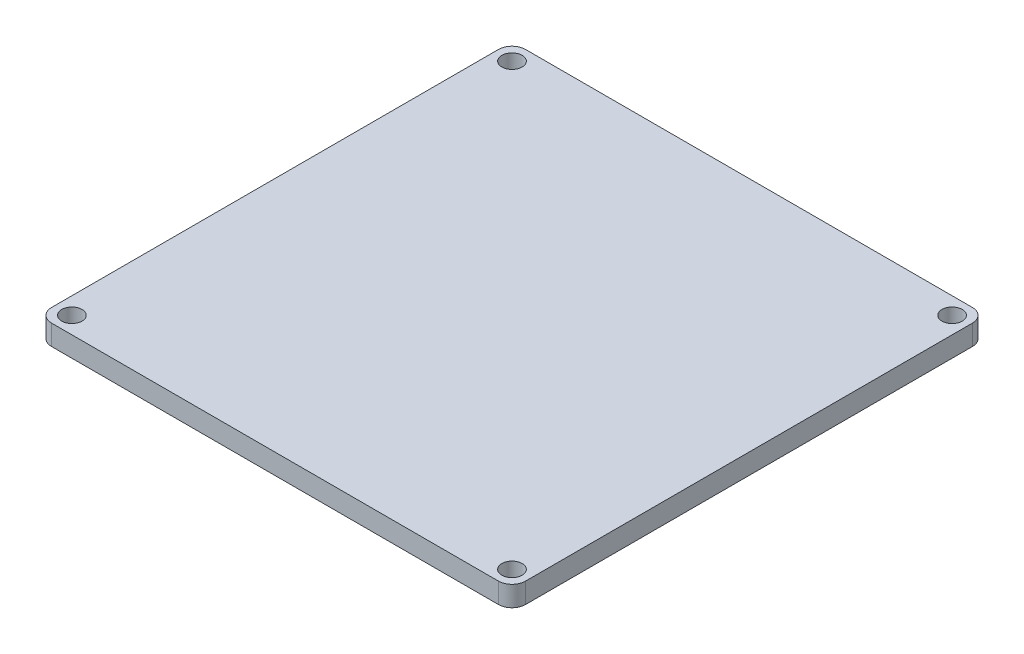
ISO-10303-21;
HEADER;
FILE_DESCRIPTION(('STEP AP214'),'2;1');
FILE_NAME('part.step','',(''),(''),'','','');
FILE_SCHEMA(('AUTOMOTIVE_DESIGN { 1 0 10303 214 1 1 1 1 }'));
ENDSEC;
DATA;
#1=APPLICATION_CONTEXT('core data for automotive mechanical design processes');
#2=APPLICATION_PROTOCOL_DEFINITION('international standard','automotive_design',2000,#1);
#3=PRODUCT_CONTEXT('',#1,'mechanical');
#4=PRODUCT('Part','Part','',(#3));
#5=PRODUCT_RELATED_PRODUCT_CATEGORY('part','',(#4));
#6=PRODUCT_DEFINITION_FORMATION('','',#4);
#7=PRODUCT_DEFINITION_CONTEXT('part definition',#1,'design');
#8=PRODUCT_DEFINITION('design','',#6,#7);
#9=PRODUCT_DEFINITION_SHAPE('','',#8);
#10=(LENGTH_UNIT() NAMED_UNIT(*) SI_UNIT(.MILLI.,.METRE.));
#11=(NAMED_UNIT(*) PLANE_ANGLE_UNIT() SI_UNIT($,.RADIAN.));
#12=(NAMED_UNIT(*) SI_UNIT($,.STERADIAN.) SOLID_ANGLE_UNIT());
#13=UNCERTAINTY_MEASURE_WITH_UNIT(LENGTH_MEASURE(1.E-05),#10,'distance_accuracy_value','');
#14=(GEOMETRIC_REPRESENTATION_CONTEXT(3) GLOBAL_UNCERTAINTY_ASSIGNED_CONTEXT((#13)) GLOBAL_UNIT_ASSIGNED_CONTEXT((#10,
#11,#12)) REPRESENTATION_CONTEXT('',''));
#15=CARTESIAN_POINT('',(0.,0.,0.));
#16=DIRECTION('',(0.,0.,1.));
#17=DIRECTION('',(1.,0.,0.));
#18=AXIS2_PLACEMENT_3D('',#15,#16,#17);
#19=CARTESIAN_POINT('',(0.,3.,0.));
#20=DIRECTION('',(0.,1.,0.));
#21=DIRECTION('',(0.,0.,1.));
#22=AXIS2_PLACEMENT_3D('',#19,#20,#21);
#23=PLANE('',#22);
#24=CARTESIAN_POINT('',(32.5000000000007,3.,32.5));
#25=DIRECTION('',(0.,1.,0.));
#26=DIRECTION('',(0.,0.,1.));
#27=AXIS2_PLACEMENT_3D('',#24,#25,#26);
#28=CIRCLE('',#27,1.5);
#29=CARTESIAN_POINT('',(32.5000000000007,3.,34.));
#30=VERTEX_POINT('',#29);
#31=EDGE_CURVE('E188',#30,#30,#28,.T.);
#32=ORIENTED_EDGE('',*,*,#31,.F.);
#33=EDGE_LOOP('',(#32));
#34=FACE_BOUND('',#33,.T.);
#35=CARTESIAN_POINT('',(-32.5,3.,-32.5));
#36=DIRECTION('',(0.,1.,0.));
#37=DIRECTION('',(0.,0.,1.));
#38=AXIS2_PLACEMENT_3D('',#35,#36,#37);
#39=CIRCLE('',#38,1.5);
#40=CARTESIAN_POINT('',(-32.5,3.,-31.));
#41=VERTEX_POINT('',#40);
#42=EDGE_CURVE('E178',#41,#41,#39,.T.);
#43=ORIENTED_EDGE('',*,*,#42,.F.);
#44=EDGE_LOOP('',(#43));
#45=FACE_BOUND('',#44,.T.);
#46=DIRECTION('',(-1.,0.,0.));
#47=VECTOR('',#46,1.);
#48=CARTESIAN_POINT('',(-35.,3.,-35.));
#49=LINE('',#48,#47);
#50=CARTESIAN_POINT('',(33.,3.,-35.));
#51=VERTEX_POINT('',#50);
#52=CARTESIAN_POINT('',(-33.,3.,-35.));
#53=VERTEX_POINT('',#52);
#54=EDGE_CURVE('E169',#51,#53,#49,.T.);
#55=ORIENTED_EDGE('',*,*,#54,.T.);
#56=CARTESIAN_POINT('',(-33.,3.,-33.));
#57=DIRECTION('',(0.,1.,0.));
#58=DIRECTION('',(0.,0.,1.));
#59=AXIS2_PLACEMENT_3D('',#56,#57,#58);
#60=CIRCLE('',#59,2.);
#61=CARTESIAN_POINT('',(-35.,3.,-33.));
#62=VERTEX_POINT('',#61);
#63=EDGE_CURVE('E147',#53,#62,#60,.T.);
#64=ORIENTED_EDGE('',*,*,#63,.T.);
#65=DIRECTION('',(0.,0.,1.));
#66=VECTOR('',#65,1.);
#67=CARTESIAN_POINT('',(-35.,3.,-35.));
#68=LINE('',#67,#66);
#69=CARTESIAN_POINT('',(-35.,3.,33.));
#70=VERTEX_POINT('',#69);
#71=EDGE_CURVE('E117',#62,#70,#68,.T.);
#72=ORIENTED_EDGE('',*,*,#71,.T.);
#73=CARTESIAN_POINT('',(-33.,3.,33.));
#74=DIRECTION('',(0.,1.,0.));
#75=DIRECTION('',(0.,0.,1.));
#76=AXIS2_PLACEMENT_3D('',#73,#74,#75);
#77=CIRCLE('',#76,2.);
#78=CARTESIAN_POINT('',(-33.,3.,35.));
#79=VERTEX_POINT('',#78);
#80=EDGE_CURVE('E53',#70,#79,#77,.T.);
#81=ORIENTED_EDGE('',*,*,#80,.T.);
#82=DIRECTION('',(1.,0.,0.));
#83=VECTOR('',#82,1.);
#84=CARTESIAN_POINT('',(-35.,3.,35.));
#85=LINE('',#84,#83);
#86=CARTESIAN_POINT('',(33.,3.,35.));
#87=VERTEX_POINT('',#86);
#88=EDGE_CURVE('E133',#79,#87,#85,.T.);
#89=ORIENTED_EDGE('',*,*,#88,.T.);
#90=CARTESIAN_POINT('',(33.,3.,33.));
#91=DIRECTION('',(0.,1.,0.));
#92=DIRECTION('',(0.,0.,1.));
#93=AXIS2_PLACEMENT_3D('',#90,#91,#92);
#94=CIRCLE('',#93,2.);
#95=CARTESIAN_POINT('',(35.,3.,33.));
#96=VERTEX_POINT('',#95);
#97=EDGE_CURVE('E143',#87,#96,#94,.T.);
#98=ORIENTED_EDGE('',*,*,#97,.T.);
#99=DIRECTION('',(0.,0.,-1.));
#100=VECTOR('',#99,1.);
#101=CARTESIAN_POINT('',(35.,3.,-35.));
#102=LINE('',#101,#100);
#103=CARTESIAN_POINT('',(35.,3.,-33.));
#104=VERTEX_POINT('',#103);
#105=EDGE_CURVE('E127',#96,#104,#102,.T.);
#106=ORIENTED_EDGE('',*,*,#105,.T.);
#107=CARTESIAN_POINT('',(33.,3.,-33.));
#108=DIRECTION('',(0.,1.,0.));
#109=DIRECTION('',(0.,0.,1.));
#110=AXIS2_PLACEMENT_3D('',#107,#108,#109);
#111=CIRCLE('',#110,2.);
#112=EDGE_CURVE('E145',#104,#51,#111,.T.);
#113=ORIENTED_EDGE('',*,*,#112,.T.);
#114=EDGE_LOOP('',(#55,#64,#72,#81,#89,#98,#106,#113));
#115=FACE_BOUND('',#114,.T.);
#116=CARTESIAN_POINT('',(32.5,3.,-32.5));
#117=DIRECTION('',(0.,1.,0.));
#118=DIRECTION('',(0.,0.,1.));
#119=AXIS2_PLACEMENT_3D('',#116,#117,#118);
#120=CIRCLE('',#119,1.5);
#121=CARTESIAN_POINT('',(32.5,3.,-31.));
#122=VERTEX_POINT('',#121);
#123=EDGE_CURVE('E183',#122,#122,#120,.T.);
#124=ORIENTED_EDGE('',*,*,#123,.F.);
#125=EDGE_LOOP('',(#124));
#126=FACE_BOUND('',#125,.T.);
#127=CARTESIAN_POINT('',(-32.4999999999993,3.,32.5));
#128=DIRECTION('',(0.,1.,0.));
#129=DIRECTION('',(0.,0.,1.));
#130=AXIS2_PLACEMENT_3D('',#127,#128,#129);
#131=CIRCLE('',#130,1.5);
#132=CARTESIAN_POINT('',(-32.4999999999993,3.,34.));
#133=VERTEX_POINT('',#132);
#134=EDGE_CURVE('E194',#133,#133,#131,.T.);
#135=ORIENTED_EDGE('',*,*,#134,.F.);
#136=EDGE_LOOP('',(#135));
#137=FACE_BOUND('',#136,.T.);
#138=ADVANCED_FACE('F33',(#34,#45,#115,#126,#137),#23,.T.);
#139=CARTESIAN_POINT('',(0.,0.,0.));
#140=DIRECTION('',(0.,1.,0.));
#141=DIRECTION('',(0.,0.,1.));
#142=AXIS2_PLACEMENT_3D('',#139,#140,#141);
#143=PLANE('',#142);
#144=DIRECTION('',(0.,0.,1.));
#145=VECTOR('',#144,1.);
#146=CARTESIAN_POINT('',(-35.,0.,-35.));
#147=LINE('',#146,#145);
#148=CARTESIAN_POINT('',(-35.,0.,-33.));
#149=VERTEX_POINT('',#148);
#150=CARTESIAN_POINT('',(-35.,0.,33.));
#151=VERTEX_POINT('',#150);
#152=EDGE_CURVE('E115',#149,#151,#147,.T.);
#153=ORIENTED_EDGE('',*,*,#152,.F.);
#154=CARTESIAN_POINT('',(-33.,0.,-33.));
#155=DIRECTION('',(0.,1.,0.));
#156=DIRECTION('',(0.,0.,1.));
#157=AXIS2_PLACEMENT_3D('',#154,#155,#156);
#158=CIRCLE('',#157,2.);
#159=CARTESIAN_POINT('',(-33.,0.,-35.));
#160=VERTEX_POINT('',#159);
#161=EDGE_CURVE('E98',#149,#160,#158,.F.);
#162=ORIENTED_EDGE('',*,*,#161,.T.);
#163=DIRECTION('',(-1.,0.,0.));
#164=VECTOR('',#163,1.);
#165=CARTESIAN_POINT('',(-35.,0.,-35.));
#166=LINE('',#165,#164);
#167=CARTESIAN_POINT('',(33.,0.,-35.));
#168=VERTEX_POINT('',#167);
#169=EDGE_CURVE('E125',#168,#160,#166,.T.);
#170=ORIENTED_EDGE('',*,*,#169,.F.);
#171=CARTESIAN_POINT('',(33.,0.,-33.));
#172=DIRECTION('',(0.,1.,0.));
#173=DIRECTION('',(0.,0.,1.));
#174=AXIS2_PLACEMENT_3D('',#171,#172,#173);
#175=CIRCLE('',#174,2.);
#176=CARTESIAN_POINT('',(35.,0.,-33.));
#177=VERTEX_POINT('',#176);
#178=EDGE_CURVE('E109',#168,#177,#175,.F.);
#179=ORIENTED_EDGE('',*,*,#178,.T.);
#180=DIRECTION('',(0.,0.,-1.));
#181=VECTOR('',#180,1.);
#182=CARTESIAN_POINT('',(35.,0.,-35.));
#183=LINE('',#182,#181);
#184=CARTESIAN_POINT('',(35.,0.,33.));
#185=VERTEX_POINT('',#184);
#186=EDGE_CURVE('E129',#185,#177,#183,.T.);
#187=ORIENTED_EDGE('',*,*,#186,.F.);
#188=CARTESIAN_POINT('',(33.,0.,33.));
#189=DIRECTION('',(0.,1.,0.));
#190=DIRECTION('',(0.,0.,1.));
#191=AXIS2_PLACEMENT_3D('',#188,#189,#190);
#192=CIRCLE('',#191,2.);
#193=CARTESIAN_POINT('',(33.,0.,35.));
#194=VERTEX_POINT('',#193);
#195=EDGE_CURVE('E136',#185,#194,#192,.F.);
#196=ORIENTED_EDGE('',*,*,#195,.T.);
#197=DIRECTION('',(1.,0.,0.));
#198=VECTOR('',#197,1.);
#199=CARTESIAN_POINT('',(-35.,0.,35.));
#200=LINE('',#199,#198);
#201=CARTESIAN_POINT('',(-33.,0.,35.));
#202=VERTEX_POINT('',#201);
#203=EDGE_CURVE('E124',#202,#194,#200,.T.);
#204=ORIENTED_EDGE('',*,*,#203,.F.);
#205=CARTESIAN_POINT('',(-33.,0.,33.));
#206=DIRECTION('',(0.,1.,0.));
#207=DIRECTION('',(0.,0.,1.));
#208=AXIS2_PLACEMENT_3D('',#205,#206,#207);
#209=CIRCLE('',#208,2.);
#210=EDGE_CURVE('E118',#202,#151,#209,.F.);
#211=ORIENTED_EDGE('',*,*,#210,.T.);
#212=EDGE_LOOP('',(#153,#162,#170,#179,#187,#196,#204,#211));
#213=FACE_BOUND('',#212,.T.);
#214=CARTESIAN_POINT('',(-32.5,0.,-32.5));
#215=DIRECTION('',(0.,1.,0.));
#216=DIRECTION('',(0.,0.,1.));
#217=AXIS2_PLACEMENT_3D('',#214,#215,#216);
#218=CIRCLE('',#217,1.5);
#219=CARTESIAN_POINT('',(-32.5,0.,-31.));
#220=VERTEX_POINT('',#219);
#221=EDGE_CURVE('E174',#220,#220,#218,.T.);
#222=ORIENTED_EDGE('',*,*,#221,.T.);
#223=EDGE_LOOP('',(#222));
#224=FACE_BOUND('',#223,.T.);
#225=CARTESIAN_POINT('',(32.5,0.,-32.5));
#226=DIRECTION('',(0.,1.,0.));
#227=DIRECTION('',(0.,0.,1.));
#228=AXIS2_PLACEMENT_3D('',#225,#226,#227);
#229=CIRCLE('',#228,1.5);
#230=CARTESIAN_POINT('',(32.5,0.,-31.));
#231=VERTEX_POINT('',#230);
#232=EDGE_CURVE('E185',#231,#231,#229,.T.);
#233=ORIENTED_EDGE('',*,*,#232,.T.);
#234=EDGE_LOOP('',(#233));
#235=FACE_BOUND('',#234,.T.);
#236=CARTESIAN_POINT('',(32.5000000000007,0.,32.5));
#237=DIRECTION('',(0.,1.,0.));
#238=DIRECTION('',(0.,0.,1.));
#239=AXIS2_PLACEMENT_3D('',#236,#237,#238);
#240=CIRCLE('',#239,1.5);
#241=CARTESIAN_POINT('',(32.5000000000007,0.,34.));
#242=VERTEX_POINT('',#241);
#243=EDGE_CURVE('E191',#242,#242,#240,.T.);
#244=ORIENTED_EDGE('',*,*,#243,.T.);
#245=EDGE_LOOP('',(#244));
#246=FACE_BOUND('',#245,.T.);
#247=CARTESIAN_POINT('',(-32.4999999999993,0.,32.5));
#248=DIRECTION('',(0.,1.,0.));
#249=DIRECTION('',(0.,0.,1.));
#250=AXIS2_PLACEMENT_3D('',#247,#248,#249);
#251=CIRCLE('',#250,1.5);
#252=CARTESIAN_POINT('',(-32.4999999999993,0.,34.));
#253=VERTEX_POINT('',#252);
#254=EDGE_CURVE('E197',#253,#253,#251,.T.);
#255=ORIENTED_EDGE('',*,*,#254,.T.);
#256=EDGE_LOOP('',(#255));
#257=FACE_BOUND('',#256,.T.);
#258=ADVANCED_FACE('F121',(#213,#224,#235,#246,#257),#143,.F.);
#259=CARTESIAN_POINT('',(35.,3.,-35.));
#260=DIRECTION('',(-1.,0.,0.));
#261=DIRECTION('',(0.,0.,1.));
#262=AXIS2_PLACEMENT_3D('',#259,#260,#261);
#263=PLANE('',#262);
#264=ORIENTED_EDGE('',*,*,#186,.T.);
#265=DIRECTION('',(0.,-1.,0.));
#266=VECTOR('',#265,1.);
#267=CARTESIAN_POINT('',(35.,3.,-33.));
#268=LINE('',#267,#266);
#269=EDGE_CURVE('E152',#177,#104,#268,.F.);
#270=ORIENTED_EDGE('',*,*,#269,.T.);
#271=ORIENTED_EDGE('',*,*,#105,.F.);
#272=DIRECTION('',(0.,-1.,0.));
#273=VECTOR('',#272,1.);
#274=CARTESIAN_POINT('',(35.,3.,33.));
#275=LINE('',#274,#273);
#276=EDGE_CURVE('E149',#96,#185,#275,.T.);
#277=ORIENTED_EDGE('',*,*,#276,.T.);
#278=EDGE_LOOP('',(#264,#270,#271,#277));
#279=FACE_BOUND('',#278,.T.);
#280=ADVANCED_FACE('F165',(#279),#263,.F.);
#281=CARTESIAN_POINT('',(-35.,3.,-35.));
#282=DIRECTION('',(0.,0.,1.));
#283=DIRECTION('',(1.,0.,0.));
#284=AXIS2_PLACEMENT_3D('',#281,#282,#283);
#285=PLANE('',#284);
#286=ORIENTED_EDGE('',*,*,#169,.T.);
#287=DIRECTION('',(0.,-1.,0.));
#288=VECTOR('',#287,1.);
#289=CARTESIAN_POINT('',(-33.,3.,-35.));
#290=LINE('',#289,#288);
#291=EDGE_CURVE('E103',#160,#53,#290,.F.);
#292=ORIENTED_EDGE('',*,*,#291,.T.);
#293=ORIENTED_EDGE('',*,*,#54,.F.);
#294=DIRECTION('',(0.,-1.,0.));
#295=VECTOR('',#294,1.);
#296=CARTESIAN_POINT('',(33.,3.,-35.));
#297=LINE('',#296,#295);
#298=EDGE_CURVE('E108',#51,#168,#297,.T.);
#299=ORIENTED_EDGE('',*,*,#298,.T.);
#300=EDGE_LOOP('',(#286,#292,#293,#299));
#301=FACE_BOUND('',#300,.T.);
#302=ADVANCED_FACE('F223',(#301),#285,.F.);
#303=CARTESIAN_POINT('',(-35.,3.,-35.));
#304=DIRECTION('',(1.,0.,0.));
#305=DIRECTION('',(0.,0.,-1.));
#306=AXIS2_PLACEMENT_3D('',#303,#304,#305);
#307=PLANE('',#306);
#308=ORIENTED_EDGE('',*,*,#71,.F.);
#309=DIRECTION('',(0.,-1.,0.));
#310=VECTOR('',#309,1.);
#311=CARTESIAN_POINT('',(-35.,3.,-33.));
#312=LINE('',#311,#310);
#313=EDGE_CURVE('E102',#62,#149,#312,.T.);
#314=ORIENTED_EDGE('',*,*,#313,.T.);
#315=ORIENTED_EDGE('',*,*,#152,.T.);
#316=DIRECTION('',(0.,-1.,0.));
#317=VECTOR('',#316,1.);
#318=CARTESIAN_POINT('',(-35.,3.,33.));
#319=LINE('',#318,#317);
#320=EDGE_CURVE('E119',#151,#70,#319,.F.);
#321=ORIENTED_EDGE('',*,*,#320,.T.);
#322=EDGE_LOOP('',(#308,#314,#315,#321));
#323=FACE_BOUND('',#322,.T.);
#324=ADVANCED_FACE('F114',(#323),#307,.F.);
#325=CARTESIAN_POINT('',(-35.,3.,35.));
#326=DIRECTION('',(0.,0.,-1.));
#327=DIRECTION('',(-1.,0.,0.));
#328=AXIS2_PLACEMENT_3D('',#325,#326,#327);
#329=PLANE('',#328);
#330=ORIENTED_EDGE('',*,*,#203,.T.);
#331=DIRECTION('',(0.,-1.,0.));
#332=VECTOR('',#331,1.);
#333=CARTESIAN_POINT('',(33.,3.,35.));
#334=LINE('',#333,#332);
#335=EDGE_CURVE('E11',#194,#87,#334,.F.);
#336=ORIENTED_EDGE('',*,*,#335,.T.);
#337=ORIENTED_EDGE('',*,*,#88,.F.);
#338=DIRECTION('',(0.,-1.,0.));
#339=VECTOR('',#338,1.);
#340=CARTESIAN_POINT('',(-33.,3.,35.));
#341=LINE('',#340,#339);
#342=EDGE_CURVE('E41',#79,#202,#341,.T.);
#343=ORIENTED_EDGE('',*,*,#342,.T.);
#344=EDGE_LOOP('',(#330,#336,#337,#343));
#345=FACE_BOUND('',#344,.T.);
#346=ADVANCED_FACE('F155',(#345),#329,.F.);
#347=CARTESIAN_POINT('',(-32.5,3.,-32.5));
#348=DIRECTION('',(0.,-1.,0.));
#349=DIRECTION('',(0.,0.,-1.));
#350=AXIS2_PLACEMENT_3D('',#347,#348,#349);
#351=CYLINDRICAL_SURFACE('',#350,1.5);
#352=ORIENTED_EDGE('',*,*,#42,.T.);
#353=EDGE_LOOP('',(#352));
#354=FACE_BOUND('',#353,.T.);
#355=ORIENTED_EDGE('',*,*,#221,.F.);
#356=EDGE_LOOP('',(#355));
#357=FACE_BOUND('',#356,.T.);
#358=ADVANCED_FACE('F216',(#354,#357),#351,.F.);
#359=CARTESIAN_POINT('',(32.5,3.,-32.5));
#360=DIRECTION('',(0.,-1.,0.));
#361=DIRECTION('',(0.,0.,-1.));
#362=AXIS2_PLACEMENT_3D('',#359,#360,#361);
#363=CYLINDRICAL_SURFACE('',#362,1.5);
#364=ORIENTED_EDGE('',*,*,#123,.T.);
#365=EDGE_LOOP('',(#364));
#366=FACE_BOUND('',#365,.T.);
#367=ORIENTED_EDGE('',*,*,#232,.F.);
#368=EDGE_LOOP('',(#367));
#369=FACE_BOUND('',#368,.T.);
#370=ADVANCED_FACE('F245',(#366,#369),#363,.F.);
#371=CARTESIAN_POINT('',(32.5000000000007,3.,32.5));
#372=DIRECTION('',(0.,-1.,0.));
#373=DIRECTION('',(0.,0.,-1.));
#374=AXIS2_PLACEMENT_3D('',#371,#372,#373);
#375=CYLINDRICAL_SURFACE('',#374,1.5);
#376=ORIENTED_EDGE('',*,*,#31,.T.);
#377=EDGE_LOOP('',(#376));
#378=FACE_BOUND('',#377,.T.);
#379=ORIENTED_EDGE('',*,*,#243,.F.);
#380=EDGE_LOOP('',(#379));
#381=FACE_BOUND('',#380,.T.);
#382=ADVANCED_FACE('F248',(#378,#381),#375,.F.);
#383=CARTESIAN_POINT('',(-32.4999999999993,3.,32.5));
#384=DIRECTION('',(0.,-1.,0.));
#385=DIRECTION('',(0.,0.,-1.));
#386=AXIS2_PLACEMENT_3D('',#383,#384,#385);
#387=CYLINDRICAL_SURFACE('',#386,1.5);
#388=ORIENTED_EDGE('',*,*,#134,.T.);
#389=EDGE_LOOP('',(#388));
#390=FACE_BOUND('',#389,.T.);
#391=ORIENTED_EDGE('',*,*,#254,.F.);
#392=EDGE_LOOP('',(#391));
#393=FACE_BOUND('',#392,.T.);
#394=ADVANCED_FACE('F203',(#390,#393),#387,.F.);
#395=CARTESIAN_POINT('',(-33.,3.,-33.));
#396=DIRECTION('',(0.,-1.,0.));
#397=DIRECTION('',(0.,0.,-1.));
#398=AXIS2_PLACEMENT_3D('',#395,#396,#397);
#399=CYLINDRICAL_SURFACE('',#398,2.);
#400=ORIENTED_EDGE('',*,*,#63,.F.);
#401=ORIENTED_EDGE('',*,*,#291,.F.);
#402=ORIENTED_EDGE('',*,*,#161,.F.);
#403=ORIENTED_EDGE('',*,*,#313,.F.);
#404=EDGE_LOOP('',(#400,#401,#402,#403));
#405=FACE_BOUND('',#404,.T.);
#406=ADVANCED_FACE('F101',(#405),#399,.T.);
#407=CARTESIAN_POINT('',(33.,3.,-33.));
#408=DIRECTION('',(0.,-1.,0.));
#409=DIRECTION('',(0.,0.,-1.));
#410=AXIS2_PLACEMENT_3D('',#407,#408,#409);
#411=CYLINDRICAL_SURFACE('',#410,2.);
#412=ORIENTED_EDGE('',*,*,#112,.F.);
#413=ORIENTED_EDGE('',*,*,#269,.F.);
#414=ORIENTED_EDGE('',*,*,#178,.F.);
#415=ORIENTED_EDGE('',*,*,#298,.F.);
#416=EDGE_LOOP('',(#412,#413,#414,#415));
#417=FACE_BOUND('',#416,.T.);
#418=ADVANCED_FACE('F231',(#417),#411,.T.);
#419=CARTESIAN_POINT('',(33.,3.,33.));
#420=DIRECTION('',(0.,-1.,0.));
#421=DIRECTION('',(0.,0.,-1.));
#422=AXIS2_PLACEMENT_3D('',#419,#420,#421);
#423=CYLINDRICAL_SURFACE('',#422,2.);
#424=ORIENTED_EDGE('',*,*,#97,.F.);
#425=ORIENTED_EDGE('',*,*,#335,.F.);
#426=ORIENTED_EDGE('',*,*,#195,.F.);
#427=ORIENTED_EDGE('',*,*,#276,.F.);
#428=EDGE_LOOP('',(#424,#425,#426,#427));
#429=FACE_BOUND('',#428,.T.);
#430=ADVANCED_FACE('F162',(#429),#423,.T.);
#431=CARTESIAN_POINT('',(-33.,3.,33.));
#432=DIRECTION('',(0.,-1.,0.));
#433=DIRECTION('',(0.,0.,-1.));
#434=AXIS2_PLACEMENT_3D('',#431,#432,#433);
#435=CYLINDRICAL_SURFACE('',#434,2.);
#436=ORIENTED_EDGE('',*,*,#80,.F.);
#437=ORIENTED_EDGE('',*,*,#320,.F.);
#438=ORIENTED_EDGE('',*,*,#210,.F.);
#439=ORIENTED_EDGE('',*,*,#342,.F.);
#440=EDGE_LOOP('',(#436,#437,#438,#439));
#441=FACE_BOUND('',#440,.T.);
#442=ADVANCED_FACE('F35',(#441),#435,.T.);
#443=CLOSED_SHELL('',(#138,#258,#280,#302,#324,#346,#358,#370,#382,#394,#406,#418,#430,#442));
#444=MANIFOLD_SOLID_BREP('B2',#443);
#445=ADVANCED_BREP_SHAPE_REPRESENTATION('',(#18,#444),#14);
#446=SHAPE_DEFINITION_REPRESENTATION(#9,#445);
ENDSEC;
END-ISO-10303-21;
